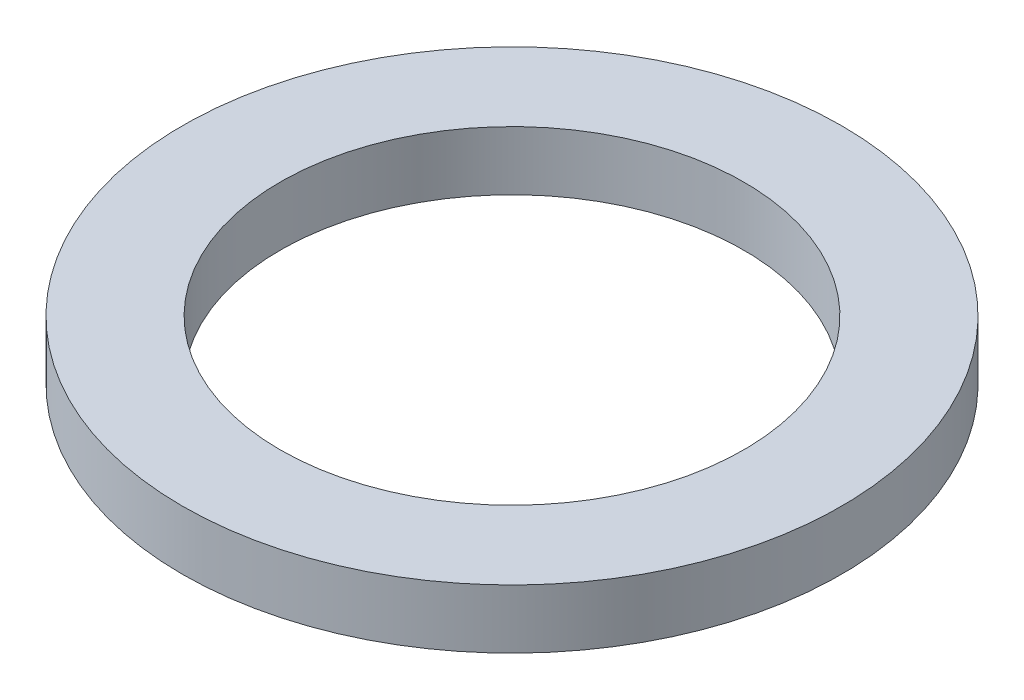
ISO-10303-21;
HEADER;
FILE_DESCRIPTION(('STEP AP214'),'2;1');
FILE_NAME('part.step','',(''),(''),'','','');
FILE_SCHEMA(('AUTOMOTIVE_DESIGN { 1 0 10303 214 1 1 1 1 }'));
ENDSEC;
DATA;
#1=APPLICATION_CONTEXT('core data for automotive mechanical design processes');
#2=APPLICATION_PROTOCOL_DEFINITION('international standard','automotive_design',2000,#1);
#3=PRODUCT_CONTEXT('',#1,'mechanical');
#4=PRODUCT('Part','Part','',(#3));
#5=PRODUCT_RELATED_PRODUCT_CATEGORY('part','',(#4));
#6=PRODUCT_DEFINITION_FORMATION('','',#4);
#7=PRODUCT_DEFINITION_CONTEXT('part definition',#1,'design');
#8=PRODUCT_DEFINITION('design','',#6,#7);
#9=PRODUCT_DEFINITION_SHAPE('','',#8);
#10=(LENGTH_UNIT() NAMED_UNIT(*) SI_UNIT(.MILLI.,.METRE.));
#11=(NAMED_UNIT(*) PLANE_ANGLE_UNIT() SI_UNIT($,.RADIAN.));
#12=(NAMED_UNIT(*) SI_UNIT($,.STERADIAN.) SOLID_ANGLE_UNIT());
#13=UNCERTAINTY_MEASURE_WITH_UNIT(LENGTH_MEASURE(1.E-05),#10,'distance_accuracy_value','');
#14=(GEOMETRIC_REPRESENTATION_CONTEXT(3) GLOBAL_UNCERTAINTY_ASSIGNED_CONTEXT((#13)) GLOBAL_UNIT_ASSIGNED_CONTEXT((#10,
#11,#12)) REPRESENTATION_CONTEXT('',''));
#15=CARTESIAN_POINT('',(0.,0.,0.));
#16=DIRECTION('',(0.,0.,1.));
#17=DIRECTION('',(1.,0.,0.));
#18=AXIS2_PLACEMENT_3D('',#15,#16,#17);
#19=CARTESIAN_POINT('',(0.,2.,0.));
#20=DIRECTION('',(0.,1.,0.));
#21=DIRECTION('',(0.,0.,1.));
#22=AXIS2_PLACEMENT_3D('',#19,#20,#21);
#23=PLANE('',#22);
#24=CARTESIAN_POINT('',(0.,2.,0.));
#25=DIRECTION('',(0.,1.,0.));
#26=DIRECTION('',(0.,0.,1.));
#27=AXIS2_PLACEMENT_3D('',#24,#25,#26);
#28=CIRCLE('',#27,11.1633);
#29=CARTESIAN_POINT('',(0.,2.,11.1633));
#30=VERTEX_POINT('',#29);
#31=EDGE_CURVE('E10',#30,#30,#28,.T.);
#32=ORIENTED_EDGE('',*,*,#31,.T.);
#33=EDGE_LOOP('',(#32));
#34=FACE_BOUND('',#33,.T.);
#35=CARTESIAN_POINT('',(0.,2.,0.));
#36=DIRECTION('',(0.,1.,0.));
#37=DIRECTION('',(0.,0.,1.));
#38=AXIS2_PLACEMENT_3D('',#35,#36,#37);
#39=CIRCLE('',#38,7.85495);
#40=CARTESIAN_POINT('',(0.,2.,7.85495));
#41=VERTEX_POINT('',#40);
#42=EDGE_CURVE('E50',#41,#41,#39,.T.);
#43=ORIENTED_EDGE('',*,*,#42,.F.);
#44=EDGE_LOOP('',(#43));
#45=FACE_BOUND('',#44,.T.);
#46=ADVANCED_FACE('F37',(#34,#45),#23,.T.);
#47=CARTESIAN_POINT('',(0.,0.,0.));
#48=DIRECTION('',(0.,1.,0.));
#49=DIRECTION('',(0.,0.,1.));
#50=AXIS2_PLACEMENT_3D('',#47,#48,#49);
#51=PLANE('',#50);
#52=CARTESIAN_POINT('',(0.,0.,0.));
#53=DIRECTION('',(0.,1.,0.));
#54=DIRECTION('',(0.,0.,1.));
#55=AXIS2_PLACEMENT_3D('',#52,#53,#54);
#56=CIRCLE('',#55,11.1633);
#57=CARTESIAN_POINT('',(0.,0.,11.1633));
#58=VERTEX_POINT('',#57);
#59=EDGE_CURVE('E41',#58,#58,#56,.T.);
#60=ORIENTED_EDGE('',*,*,#59,.F.);
#61=EDGE_LOOP('',(#60));
#62=FACE_BOUND('',#61,.T.);
#63=CARTESIAN_POINT('',(0.,0.,0.));
#64=DIRECTION('',(0.,1.,0.));
#65=DIRECTION('',(0.,0.,1.));
#66=AXIS2_PLACEMENT_3D('',#63,#64,#65);
#67=CIRCLE('',#66,7.85495);
#68=CARTESIAN_POINT('',(0.,0.,7.85495));
#69=VERTEX_POINT('',#68);
#70=EDGE_CURVE('E52',#69,#69,#67,.T.);
#71=ORIENTED_EDGE('',*,*,#70,.T.);
#72=EDGE_LOOP('',(#71));
#73=FACE_BOUND('',#72,.T.);
#74=ADVANCED_FACE('F64',(#62,#73),#51,.F.);
#75=CARTESIAN_POINT('',(0.,2.,0.));
#76=DIRECTION('',(0.,-1.,0.));
#77=DIRECTION('',(0.,0.,-1.));
#78=AXIS2_PLACEMENT_3D('',#75,#76,#77);
#79=CYLINDRICAL_SURFACE('',#78,11.1633);
#80=ORIENTED_EDGE('',*,*,#31,.F.);
#81=EDGE_LOOP('',(#80));
#82=FACE_BOUND('',#81,.T.);
#83=ORIENTED_EDGE('',*,*,#59,.T.);
#84=EDGE_LOOP('',(#83));
#85=FACE_BOUND('',#84,.T.);
#86=ADVANCED_FACE('F39',(#82,#85),#79,.T.);
#87=CARTESIAN_POINT('',(0.,2.,0.));
#88=DIRECTION('',(0.,-1.,0.));
#89=DIRECTION('',(0.,0.,-1.));
#90=AXIS2_PLACEMENT_3D('',#87,#88,#89);
#91=CYLINDRICAL_SURFACE('',#90,7.85495);
#92=ORIENTED_EDGE('',*,*,#42,.T.);
#93=EDGE_LOOP('',(#92));
#94=FACE_BOUND('',#93,.T.);
#95=ORIENTED_EDGE('',*,*,#70,.F.);
#96=EDGE_LOOP('',(#95));
#97=FACE_BOUND('',#96,.T.);
#98=ADVANCED_FACE('F60',(#94,#97),#91,.F.);
#99=CLOSED_SHELL('',(#46,#74,#86,#98));
#100=MANIFOLD_SOLID_BREP('B2',#99);
#101=ADVANCED_BREP_SHAPE_REPRESENTATION('',(#18,#100),#14);
#102=SHAPE_DEFINITION_REPRESENTATION(#9,#101);
ENDSEC;
END-ISO-10303-21;
